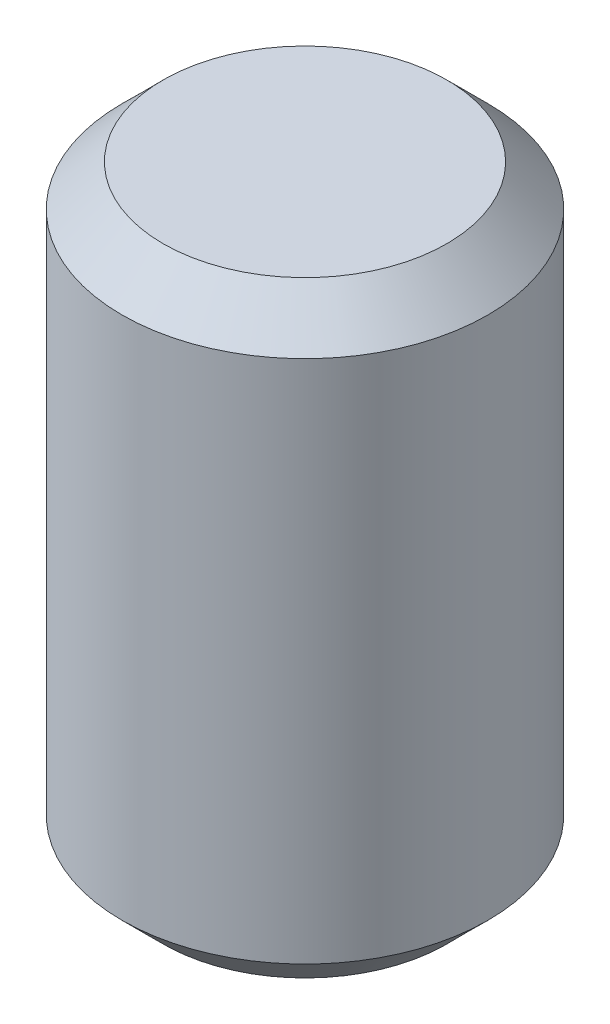
ISO-10303-21;
HEADER;
FILE_DESCRIPTION(('STEP AP214'),'2;1');
FILE_NAME('part.step','',(''),(''),'','','');
FILE_SCHEMA(('AUTOMOTIVE_DESIGN { 1 0 10303 214 1 1 1 1 }'));
ENDSEC;
DATA;
#1=APPLICATION_CONTEXT('core data for automotive mechanical design processes');
#2=APPLICATION_PROTOCOL_DEFINITION('international standard','automotive_design',2000,#1);
#3=PRODUCT_CONTEXT('',#1,'mechanical');
#4=PRODUCT('Part','Part','',(#3));
#5=PRODUCT_RELATED_PRODUCT_CATEGORY('part','',(#4));
#6=PRODUCT_DEFINITION_FORMATION('','',#4);
#7=PRODUCT_DEFINITION_CONTEXT('part definition',#1,'design');
#8=PRODUCT_DEFINITION('design','',#6,#7);
#9=PRODUCT_DEFINITION_SHAPE('','',#8);
#10=(LENGTH_UNIT() NAMED_UNIT(*) SI_UNIT(.MILLI.,.METRE.));
#11=(NAMED_UNIT(*) PLANE_ANGLE_UNIT() SI_UNIT($,.RADIAN.));
#12=(NAMED_UNIT(*) SI_UNIT($,.STERADIAN.) SOLID_ANGLE_UNIT());
#13=UNCERTAINTY_MEASURE_WITH_UNIT(LENGTH_MEASURE(1.E-05),#10,'distance_accuracy_value','');
#14=(GEOMETRIC_REPRESENTATION_CONTEXT(3) GLOBAL_UNCERTAINTY_ASSIGNED_CONTEXT((#13)) GLOBAL_UNIT_ASSIGNED_CONTEXT((#10,
#11,#12)) REPRESENTATION_CONTEXT('',''));
#15=CARTESIAN_POINT('',(0.,0.,0.));
#16=DIRECTION('',(0.,0.,1.));
#17=DIRECTION('',(1.,0.,0.));
#18=AXIS2_PLACEMENT_3D('',#15,#16,#17);
#19=CARTESIAN_POINT('',(0.,0.,0.));
#20=DIRECTION('',(0.,1.,0.));
#21=DIRECTION('',(0.,0.,1.));
#22=AXIS2_PLACEMENT_3D('',#19,#20,#21);
#23=CYLINDRICAL_SURFACE('',#22,0.89);
#24=CARTESIAN_POINT('',(0.,0.199999999989195,0.));
#25=DIRECTION('',(0.,-1.,0.));
#26=DIRECTION('',(0.,0.,-1.));
#27=AXIS2_PLACEMENT_3D('',#24,#25,#26);
#28=CIRCLE('',#27,0.89);
#29=CARTESIAN_POINT('',(0.,0.199999999989195,-0.89));
#30=VERTEX_POINT('',#29);
#31=EDGE_CURVE('E154',#30,#30,#28,.F.);
#32=ORIENTED_EDGE('',*,*,#31,.T.);
#33=EDGE_LOOP('',(#32));
#34=FACE_BOUND('',#33,.T.);
#35=CARTESIAN_POINT('',(0.,2.74999999995396,0.));
#36=DIRECTION('',(0.,1.,0.));
#37=DIRECTION('',(0.,0.,1.));
#38=AXIS2_PLACEMENT_3D('',#35,#36,#37);
#39=CIRCLE('',#38,0.89);
#40=CARTESIAN_POINT('',(0.,2.74999999995396,0.89));
#41=VERTEX_POINT('',#40);
#42=EDGE_CURVE('E146',#41,#41,#39,.F.);
#43=ORIENTED_EDGE('',*,*,#42,.T.);
#44=EDGE_LOOP('',(#43));
#45=FACE_BOUND('',#44,.T.);
#46=ADVANCED_FACE('F44',(#34,#45),#23,.T.);
#47=CARTESIAN_POINT('',(0.89,0.,0.));
#48=DIRECTION('',(0.,-1.,0.));
#49=DIRECTION('',(0.,0.,-1.));
#50=AXIS2_PLACEMENT_3D('',#47,#48,#49);
#51=PLANE('',#50);
#52=CARTESIAN_POINT('',(0.,0.,0.));
#53=DIRECTION('',(0.,-1.,0.));
#54=DIRECTION('',(0.,0.,-1.));
#55=AXIS2_PLACEMENT_3D('',#52,#53,#54);
#56=CIRCLE('',#55,0.68999999995396);
#57=CARTESIAN_POINT('',(0.,0.,-0.68999999995396));
#58=VERTEX_POINT('',#57);
#59=EDGE_CURVE('E52',#58,#58,#56,.T.);
#60=ORIENTED_EDGE('',*,*,#59,.T.);
#61=EDGE_LOOP('',(#60));
#62=FACE_BOUND('',#61,.T.);
#63=DIRECTION('',(-1.,0.,0.));
#64=VECTOR('',#63,1.);
#65=CARTESIAN_POINT('',(0.234999999999993,0.,0.407031939778696));
#66=LINE('',#65,#64);
#67=CARTESIAN_POINT('',(0.234999999999993,0.,0.407031939778696));
#68=VERTEX_POINT('',#67);
#69=CARTESIAN_POINT('',(-0.235,0.,0.4070319397787));
#70=VERTEX_POINT('',#69);
#71=EDGE_CURVE('E59',#68,#70,#66,.T.);
#72=ORIENTED_EDGE('',*,*,#71,.F.);
#73=DIRECTION('',(-0.50000000000001,0.,0.866025403784433));
#74=VECTOR('',#73,1.);
#75=CARTESIAN_POINT('',(0.470000000000007,0.,0.));
#76=LINE('',#75,#74);
#77=CARTESIAN_POINT('',(0.470000000000007,0.,0.));
#78=VERTEX_POINT('',#77);
#79=EDGE_CURVE('E142',#78,#68,#76,.T.);
#80=ORIENTED_EDGE('',*,*,#79,.F.);
#81=DIRECTION('',(0.500000000000002,0.,0.866025403784437));
#82=VECTOR('',#81,1.);
#83=CARTESIAN_POINT('',(0.235,0.,-0.4070319397787));
#84=LINE('',#83,#82);
#85=CARTESIAN_POINT('',(0.235,0.,-0.4070319397787));
#86=VERTEX_POINT('',#85);
#87=EDGE_CURVE('E140',#86,#78,#84,.T.);
#88=ORIENTED_EDGE('',*,*,#87,.F.);
#89=DIRECTION('',(1.,0.,0.));
#90=VECTOR('',#89,1.);
#91=CARTESIAN_POINT('',(-0.234999999999996,0.,-0.407031939778698));
#92=LINE('',#91,#90);
#93=CARTESIAN_POINT('',(-0.234999999999996,0.,-0.407031939778698));
#94=VERTEX_POINT('',#93);
#95=EDGE_CURVE('E107',#94,#86,#92,.T.);
#96=ORIENTED_EDGE('',*,*,#95,.F.);
#97=DIRECTION('',(0.500000000000002,0.,-0.866025403784437));
#98=VECTOR('',#97,1.);
#99=CARTESIAN_POINT('',(-0.470000000000007,0.,0.));
#100=LINE('',#99,#98);
#101=CARTESIAN_POINT('',(-0.470000000000007,0.,0.));
#102=VERTEX_POINT('',#101);
#103=EDGE_CURVE('E136',#102,#94,#100,.T.);
#104=ORIENTED_EDGE('',*,*,#103,.F.);
#105=DIRECTION('',(-0.500000000000002,0.,-0.866025403784437));
#106=VECTOR('',#105,1.);
#107=CARTESIAN_POINT('',(-0.235,0.,0.4070319397787));
#108=LINE('',#107,#106);
#109=EDGE_CURVE('E133',#70,#102,#108,.T.);
#110=ORIENTED_EDGE('',*,*,#109,.F.);
#111=EDGE_LOOP('',(#72,#80,#88,#96,#104,#110));
#112=FACE_BOUND('',#111,.T.);
#113=ADVANCED_FACE('F159',(#62,#112),#51,.T.);
#114=CARTESIAN_POINT('',(0.,2.95,0.));
#115=DIRECTION('',(0.,1.,0.));
#116=DIRECTION('',(0.,0.,1.));
#117=AXIS2_PLACEMENT_3D('',#114,#115,#116);
#118=PLANE('',#117);
#119=CARTESIAN_POINT('',(0.,2.95,0.));
#120=DIRECTION('',(0.,1.,0.));
#121=DIRECTION('',(0.,0.,1.));
#122=AXIS2_PLACEMENT_3D('',#119,#120,#121);
#123=CIRCLE('',#122,0.690000000010805);
#124=CARTESIAN_POINT('',(0.,2.95,0.690000000010805));
#125=VERTEX_POINT('',#124);
#126=EDGE_CURVE('E13',#125,#125,#123,.T.);
#127=ORIENTED_EDGE('',*,*,#126,.T.);
#128=EDGE_LOOP('',(#127));
#129=FACE_BOUND('',#128,.T.);
#130=ADVANCED_FACE('F176',(#129),#118,.T.);
#131=CARTESIAN_POINT('',(0.234999999999993,0.375,0.407031939778696));
#132=DIRECTION('',(0.,0.,1.));
#133=DIRECTION('',(1.,0.,0.));
#134=AXIS2_PLACEMENT_3D('',#131,#132,#133);
#135=PLANE('',#134);
#136=ORIENTED_EDGE('',*,*,#71,.T.);
#137=DIRECTION('',(0.,-1.,0.));
#138=VECTOR('',#137,1.);
#139=CARTESIAN_POINT('',(-0.235,0.375,0.4070319397787));
#140=LINE('',#139,#138);
#141=CARTESIAN_POINT('',(-0.235,0.375,0.4070319397787));
#142=VERTEX_POINT('',#141);
#143=EDGE_CURVE('E89',#142,#70,#140,.T.);
#144=ORIENTED_EDGE('',*,*,#143,.F.);
#145=DIRECTION('',(-1.,0.,0.));
#146=VECTOR('',#145,1.);
#147=CARTESIAN_POINT('',(0.234999999999993,0.375,0.407031939778696));
#148=LINE('',#147,#146);
#149=CARTESIAN_POINT('',(0.234999999999993,0.375,0.407031939778696));
#150=VERTEX_POINT('',#149);
#151=EDGE_CURVE('E144',#150,#142,#148,.T.);
#152=ORIENTED_EDGE('',*,*,#151,.F.);
#153=DIRECTION('',(0.,-1.,0.));
#154=VECTOR('',#153,1.);
#155=CARTESIAN_POINT('',(0.234999999999993,0.375,0.407031939778696));
#156=LINE('',#155,#154);
#157=EDGE_CURVE('E67',#150,#68,#156,.T.);
#158=ORIENTED_EDGE('',*,*,#157,.T.);
#159=EDGE_LOOP('',(#136,#144,#152,#158));
#160=FACE_BOUND('',#159,.T.);
#161=ADVANCED_FACE('F178',(#160),#135,.F.);
#162=CARTESIAN_POINT('',(0.470000000000007,0.375,0.));
#163=DIRECTION('',(0.866025403784433,0.,0.500000000000009));
#164=DIRECTION('',(0.50000000000001,0.,-0.866025403784433));
#165=AXIS2_PLACEMENT_3D('',#162,#163,#164);
#166=PLANE('',#165);
#167=ORIENTED_EDGE('',*,*,#79,.T.);
#168=ORIENTED_EDGE('',*,*,#157,.F.);
#169=DIRECTION('',(-0.50000000000001,0.,0.866025403784433));
#170=VECTOR('',#169,1.);
#171=CARTESIAN_POINT('',(0.470000000000007,0.375,0.));
#172=LINE('',#171,#170);
#173=CARTESIAN_POINT('',(0.470000000000007,0.375,0.));
#174=VERTEX_POINT('',#173);
#175=EDGE_CURVE('E119',#174,#150,#172,.T.);
#176=ORIENTED_EDGE('',*,*,#175,.F.);
#177=DIRECTION('',(0.,-1.,0.));
#178=VECTOR('',#177,1.);
#179=CARTESIAN_POINT('',(0.470000000000007,0.375,0.));
#180=LINE('',#179,#178);
#181=EDGE_CURVE('E111',#174,#78,#180,.T.);
#182=ORIENTED_EDGE('',*,*,#181,.T.);
#183=EDGE_LOOP('',(#167,#168,#176,#182));
#184=FACE_BOUND('',#183,.T.);
#185=ADVANCED_FACE('F184',(#184),#166,.F.);
#186=CARTESIAN_POINT('',(0.235,0.375,-0.4070319397787));
#187=DIRECTION('',(0.866025403784437,0.,-0.500000000000002));
#188=DIRECTION('',(-0.500000000000002,0.,-0.866025403784438));
#189=AXIS2_PLACEMENT_3D('',#186,#187,#188);
#190=PLANE('',#189);
#191=ORIENTED_EDGE('',*,*,#87,.T.);
#192=ORIENTED_EDGE('',*,*,#181,.F.);
#193=DIRECTION('',(0.500000000000002,0.,0.866025403784437));
#194=VECTOR('',#193,1.);
#195=CARTESIAN_POINT('',(0.235,0.375,-0.4070319397787));
#196=LINE('',#195,#194);
#197=CARTESIAN_POINT('',(0.235,0.375,-0.4070319397787));
#198=VERTEX_POINT('',#197);
#199=EDGE_CURVE('E115',#198,#174,#196,.T.);
#200=ORIENTED_EDGE('',*,*,#199,.F.);
#201=DIRECTION('',(0.,-1.,0.));
#202=VECTOR('',#201,1.);
#203=CARTESIAN_POINT('',(0.235,0.375,-0.4070319397787));
#204=LINE('',#203,#202);
#205=EDGE_CURVE('E100',#198,#86,#204,.T.);
#206=ORIENTED_EDGE('',*,*,#205,.T.);
#207=EDGE_LOOP('',(#191,#192,#200,#206));
#208=FACE_BOUND('',#207,.T.);
#209=ADVANCED_FACE('F116',(#208),#190,.F.);
#210=CARTESIAN_POINT('',(-0.234999999999996,0.375,-0.407031939778698));
#211=DIRECTION('',(0.,0.,-1.));
#212=DIRECTION('',(-1.,0.,0.));
#213=AXIS2_PLACEMENT_3D('',#210,#211,#212);
#214=PLANE('',#213);
#215=ORIENTED_EDGE('',*,*,#95,.T.);
#216=ORIENTED_EDGE('',*,*,#205,.F.);
#217=DIRECTION('',(1.,0.,0.));
#218=VECTOR('',#217,1.);
#219=CARTESIAN_POINT('',(-0.234999999999996,0.375,-0.407031939778698));
#220=LINE('',#219,#218);
#221=CARTESIAN_POINT('',(-0.234999999999996,0.375,-0.407031939778698));
#222=VERTEX_POINT('',#221);
#223=EDGE_CURVE('E104',#222,#198,#220,.T.);
#224=ORIENTED_EDGE('',*,*,#223,.F.);
#225=DIRECTION('',(0.,-1.,0.));
#226=VECTOR('',#225,1.);
#227=CARTESIAN_POINT('',(-0.234999999999996,0.375,-0.407031939778698));
#228=LINE('',#227,#226);
#229=EDGE_CURVE('E112',#222,#94,#228,.T.);
#230=ORIENTED_EDGE('',*,*,#229,.T.);
#231=EDGE_LOOP('',(#215,#216,#224,#230));
#232=FACE_BOUND('',#231,.T.);
#233=ADVANCED_FACE('F102',(#232),#214,.F.);
#234=CARTESIAN_POINT('',(-0.470000000000007,0.375,0.));
#235=DIRECTION('',(-0.866025403784437,0.,-0.500000000000002));
#236=DIRECTION('',(-0.500000000000002,0.,0.866025403784438));
#237=AXIS2_PLACEMENT_3D('',#234,#235,#236);
#238=PLANE('',#237);
#239=ORIENTED_EDGE('',*,*,#103,.T.);
#240=ORIENTED_EDGE('',*,*,#229,.F.);
#241=DIRECTION('',(0.500000000000002,0.,-0.866025403784437));
#242=VECTOR('',#241,1.);
#243=CARTESIAN_POINT('',(-0.470000000000007,0.375,0.));
#244=LINE('',#243,#242);
#245=CARTESIAN_POINT('',(-0.470000000000007,0.375,0.));
#246=VERTEX_POINT('',#245);
#247=EDGE_CURVE('E125',#246,#222,#244,.T.);
#248=ORIENTED_EDGE('',*,*,#247,.F.);
#249=DIRECTION('',(0.,-1.,0.));
#250=VECTOR('',#249,1.);
#251=CARTESIAN_POINT('',(-0.470000000000007,0.375,0.));
#252=LINE('',#251,#250);
#253=EDGE_CURVE('E149',#246,#102,#252,.T.);
#254=ORIENTED_EDGE('',*,*,#253,.T.);
#255=EDGE_LOOP('',(#239,#240,#248,#254));
#256=FACE_BOUND('',#255,.T.);
#257=ADVANCED_FACE('F191',(#256),#238,.F.);
#258=CARTESIAN_POINT('',(-0.235,0.375,0.4070319397787));
#259=DIRECTION('',(-0.866025403784437,0.,0.500000000000002));
#260=DIRECTION('',(0.500000000000002,0.,0.866025403784438));
#261=AXIS2_PLACEMENT_3D('',#258,#259,#260);
#262=PLANE('',#261);
#263=ORIENTED_EDGE('',*,*,#109,.T.);
#264=ORIENTED_EDGE('',*,*,#253,.F.);
#265=DIRECTION('',(-0.500000000000002,0.,-0.866025403784437));
#266=VECTOR('',#265,1.);
#267=CARTESIAN_POINT('',(-0.235,0.375,0.4070319397787));
#268=LINE('',#267,#266);
#269=EDGE_CURVE('E127',#142,#246,#268,.T.);
#270=ORIENTED_EDGE('',*,*,#269,.F.);
#271=ORIENTED_EDGE('',*,*,#143,.T.);
#272=EDGE_LOOP('',(#263,#264,#270,#271));
#273=FACE_BOUND('',#272,.T.);
#274=ADVANCED_FACE('F188',(#273),#262,.F.);
#275=CARTESIAN_POINT('',(0.,0.375,0.));
#276=DIRECTION('',(0.,-1.,0.));
#277=DIRECTION('',(0.,0.,-1.));
#278=AXIS2_PLACEMENT_3D('',#275,#276,#277);
#279=PLANE('',#278);
#280=ORIENTED_EDGE('',*,*,#151,.T.);
#281=ORIENTED_EDGE('',*,*,#269,.T.);
#282=ORIENTED_EDGE('',*,*,#247,.T.);
#283=ORIENTED_EDGE('',*,*,#223,.T.);
#284=ORIENTED_EDGE('',*,*,#199,.T.);
#285=ORIENTED_EDGE('',*,*,#175,.T.);
#286=EDGE_LOOP('',(#280,#281,#282,#283,#284,#285));
#287=FACE_BOUND('',#286,.T.);
#288=ADVANCED_FACE('F122',(#287),#279,.T.);
#289=CARTESIAN_POINT('',(0.,0.199999999989195,0.));
#290=DIRECTION('',(0.,1.,0.));
#291=DIRECTION('',(0.,0.,1.));
#292=AXIS2_PLACEMENT_3D('',#289,#290,#291);
#293=CONICAL_SURFACE('',#292,0.89,0.78539816353956);
#294=ORIENTED_EDGE('',*,*,#59,.F.);
#295=EDGE_LOOP('',(#294));
#296=FACE_BOUND('',#295,.T.);
#297=ORIENTED_EDGE('',*,*,#31,.F.);
#298=EDGE_LOOP('',(#297));
#299=FACE_BOUND('',#298,.T.);
#300=ADVANCED_FACE('F162',(#296,#299),#293,.T.);
#301=CARTESIAN_POINT('',(0.,2.95,0.));
#302=DIRECTION('',(0.,-1.,0.));
#303=DIRECTION('',(0.,0.,-1.));
#304=AXIS2_PLACEMENT_3D('',#301,#302,#303);
#305=CONICAL_SURFACE('',#304,0.690000000010805,0.785398163255337);
#306=ORIENTED_EDGE('',*,*,#42,.F.);
#307=EDGE_LOOP('',(#306));
#308=FACE_BOUND('',#307,.T.);
#309=ORIENTED_EDGE('',*,*,#126,.F.);
#310=EDGE_LOOP('',(#309));
#311=FACE_BOUND('',#310,.T.);
#312=ADVANCED_FACE('F46',(#308,#311),#305,.T.);
#313=CLOSED_SHELL('',(#46,#113,#130,#161,#185,#209,#233,#257,#274,#288,#300,#312));
#314=MANIFOLD_SOLID_BREP('B2',#313);
#315=ADVANCED_BREP_SHAPE_REPRESENTATION('',(#18,#314),#14);
#316=SHAPE_DEFINITION_REPRESENTATION(#9,#315);
ENDSEC;
END-ISO-10303-21;
